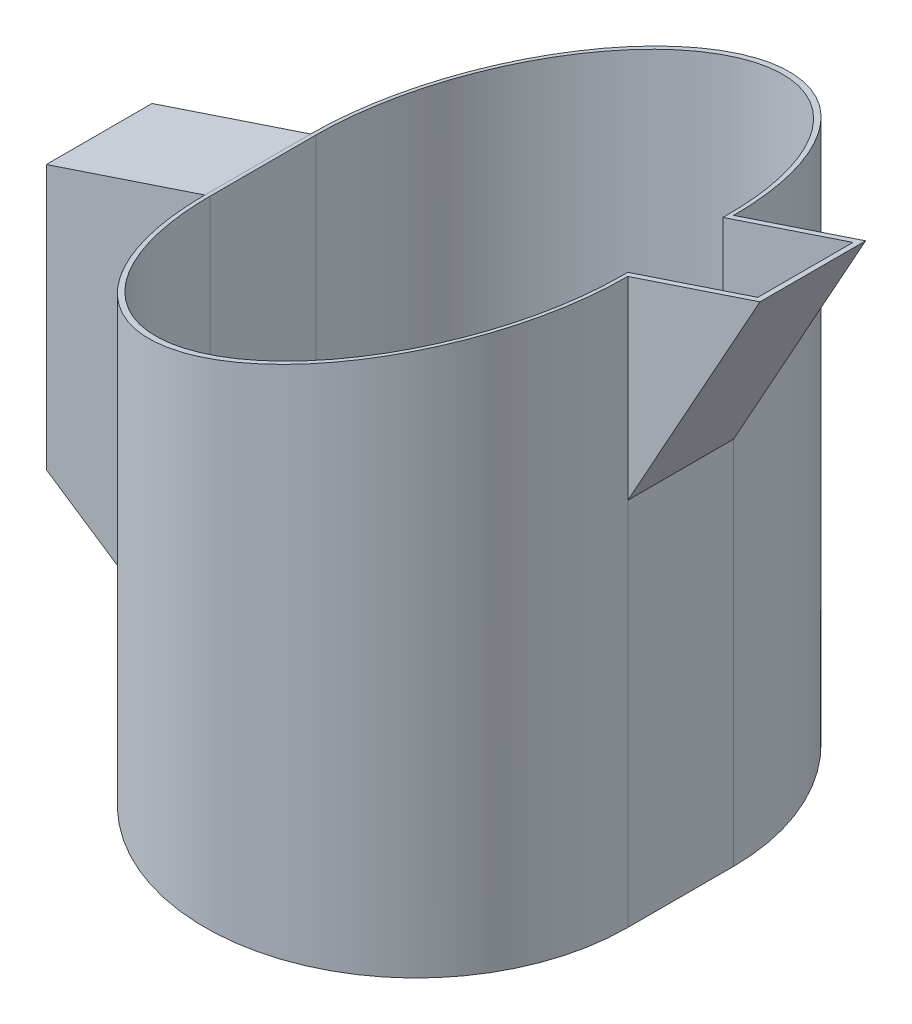
ISO-10303-21;
HEADER;
FILE_DESCRIPTION(('STEP AP214'),'2;1');
FILE_NAME('part.step','',(''),(''),'','','');
FILE_SCHEMA(('AUTOMOTIVE_DESIGN { 1 0 10303 214 1 1 1 1 }'));
ENDSEC;
DATA;
#1=APPLICATION_CONTEXT('core data for automotive mechanical design processes');
#2=APPLICATION_PROTOCOL_DEFINITION('international standard','automotive_design',2000,#1);
#3=PRODUCT_CONTEXT('',#1,'mechanical');
#4=PRODUCT('Part','Part','',(#3));
#5=PRODUCT_RELATED_PRODUCT_CATEGORY('part','',(#4));
#6=PRODUCT_DEFINITION_FORMATION('','',#4);
#7=PRODUCT_DEFINITION_CONTEXT('part definition',#1,'design');
#8=PRODUCT_DEFINITION('design','',#6,#7);
#9=PRODUCT_DEFINITION_SHAPE('','',#8);
#10=(LENGTH_UNIT() NAMED_UNIT(*) SI_UNIT(.MILLI.,.METRE.));
#11=(NAMED_UNIT(*) PLANE_ANGLE_UNIT() SI_UNIT($,.RADIAN.));
#12=(NAMED_UNIT(*) SI_UNIT($,.STERADIAN.) SOLID_ANGLE_UNIT());
#13=UNCERTAINTY_MEASURE_WITH_UNIT(LENGTH_MEASURE(1.E-05),#10,'distance_accuracy_value','');
#14=(GEOMETRIC_REPRESENTATION_CONTEXT(3) GLOBAL_UNCERTAINTY_ASSIGNED_CONTEXT((#13)) GLOBAL_UNIT_ASSIGNED_CONTEXT((#10,
#11,#12)) REPRESENTATION_CONTEXT('',''));
#15=CARTESIAN_POINT('',(0.,0.,0.));
#16=DIRECTION('',(0.,0.,1.));
#17=DIRECTION('',(1.,0.,0.));
#18=AXIS2_PLACEMENT_3D('',#15,#16,#17);
#19=CARTESIAN_POINT('',(65.,115.,10.));
#20=DIRECTION('',(0.316227766016838,-0.948683298050514,0.));
#21=DIRECTION('',(0.948683298050514,0.316227766016838,0.));
#22=AXIS2_PLACEMENT_3D('',#19,#20,#21);
#23=PLANE('',#22);
#24=DIRECTION('',(-0.948683298050514,-0.316227766016838,0.));
#25=VECTOR('',#24,1.);
#26=CARTESIAN_POINT('',(65.,115.,-10.));
#27=LINE('',#26,#25);
#28=CARTESIAN_POINT('',(65.,115.,-10.));
#29=VERTEX_POINT('',#28);
#30=CARTESIAN_POINT('',(40.,106.666666666667,-10.));
#31=VERTEX_POINT('',#30);
#32=EDGE_CURVE('E227',#29,#31,#27,.T.);
#33=ORIENTED_EDGE('',*,*,#32,.T.);
#34=CARTESIAN_POINT('',(0.,93.3333333333333,-10.));
#35=DIRECTION('',(0.316227766016838,-0.948683298050514,0.));
#36=DIRECTION('',(-0.948683298050514,-0.316227766016838,0.));
#37=AXIS2_PLACEMENT_3D('',#34,#35,#36);
#38=ELLIPSE('',#37,42.1637021355784,40.);
#39=CARTESIAN_POINT('',(-40.,80.,-10.));
#40=VERTEX_POINT('',#39);
#41=EDGE_CURVE('E201',#40,#31,#38,.T.);
#42=ORIENTED_EDGE('',*,*,#41,.F.);
#43=DIRECTION('',(0.,0.,1.));
#44=VECTOR('',#43,1.);
#45=CARTESIAN_POINT('',(-40.,80.,-50.));
#46=LINE('',#45,#44);
#47=CARTESIAN_POINT('',(-40.,80.,9.99999999999997));
#48=VERTEX_POINT('',#47);
#49=EDGE_CURVE('E195',#40,#48,#46,.T.);
#50=ORIENTED_EDGE('',*,*,#49,.T.);
#51=CARTESIAN_POINT('',(0.,93.3333333333333,9.99999999999999));
#52=DIRECTION('',(0.316227766016838,-0.948683298050514,0.));
#53=DIRECTION('',(-0.948683298050514,-0.316227766016838,0.));
#54=AXIS2_PLACEMENT_3D('',#51,#52,#53);
#55=ELLIPSE('',#54,42.1637021355784,40.);
#56=CARTESIAN_POINT('',(40.,106.666666666667,10.));
#57=VERTEX_POINT('',#56);
#58=EDGE_CURVE('E199',#57,#48,#55,.T.);
#59=ORIENTED_EDGE('',*,*,#58,.F.);
#60=DIRECTION('',(-0.948683298050514,-0.316227766016838,0.));
#61=VECTOR('',#60,1.);
#62=CARTESIAN_POINT('',(65.,115.,10.));
#63=LINE('',#62,#61);
#64=CARTESIAN_POINT('',(65.,115.,10.));
#65=VERTEX_POINT('',#64);
#66=EDGE_CURVE('E232',#65,#57,#63,.T.);
#67=ORIENTED_EDGE('',*,*,#66,.F.);
#68=DIRECTION('',(0.,0.,-1.));
#69=VECTOR('',#68,1.);
#70=CARTESIAN_POINT('',(65.,115.,10.));
#71=LINE('',#70,#69);
#72=EDGE_CURVE('E49',#65,#29,#71,.T.);
#73=ORIENTED_EDGE('',*,*,#72,.T.);
#74=EDGE_LOOP('',(#33,#42,#50,#59,#67,#73));
#75=FACE_BOUND('',#74,.T.);
#76=DIRECTION('',(-0.948683298050514,-0.316227766016838,0.));
#77=VECTOR('',#76,1.);
#78=CARTESIAN_POINT('',(65.,115.,-9.));
#79=LINE('',#78,#77);
#80=CARTESIAN_POINT('',(63.59605043532,114.532016811773,-9.));
#81=VERTEX_POINT('',#80);
#82=CARTESIAN_POINT('',(39.,106.333333333333,-9.));
#83=VERTEX_POINT('',#82);
#84=EDGE_CURVE('E183',#81,#83,#79,.T.);
#85=ORIENTED_EDGE('',*,*,#84,.F.);
#86=DIRECTION('',(0.,0.,-1.));
#87=VECTOR('',#86,1.);
#88=CARTESIAN_POINT('',(63.59605043532,114.532016811773,10.));
#89=LINE('',#88,#87);
#90=CARTESIAN_POINT('',(63.59605043532,114.532016811773,9.));
#91=VERTEX_POINT('',#90);
#92=EDGE_CURVE('E179',#91,#81,#89,.T.);
#93=ORIENTED_EDGE('',*,*,#92,.F.);
#94=DIRECTION('',(-0.948683298050514,-0.316227766016838,0.));
#95=VECTOR('',#94,1.);
#96=CARTESIAN_POINT('',(65.,115.,9.));
#97=LINE('',#96,#95);
#98=CARTESIAN_POINT('',(39.,106.333333333333,9.));
#99=VERTEX_POINT('',#98);
#100=EDGE_CURVE('E56',#91,#99,#97,.T.);
#101=ORIENTED_EDGE('',*,*,#100,.T.);
#102=DIRECTION('',(0.,0.,1.));
#103=VECTOR('',#102,1.);
#104=CARTESIAN_POINT('',(39.,106.333333333333,-10.));
#105=LINE('',#104,#103);
#106=CARTESIAN_POINT('',(39.,106.333333333333,9.99999999999999));
#107=VERTEX_POINT('',#106);
#108=EDGE_CURVE('E191',#99,#107,#105,.T.);
#109=ORIENTED_EDGE('',*,*,#108,.T.);
#110=CARTESIAN_POINT('',(0.,93.3333333333333,9.99999999999999));
#111=DIRECTION('',(0.316227766016838,-0.948683298050514,0.));
#112=DIRECTION('',(-0.948683298050514,-0.316227766016838,0.));
#113=AXIS2_PLACEMENT_3D('',#110,#111,#112);
#114=ELLIPSE('',#113,41.1096095821889,39.);
#115=CARTESIAN_POINT('',(-39.,80.3333333333333,10.));
#116=VERTEX_POINT('',#115);
#117=EDGE_CURVE('E168',#107,#116,#114,.T.);
#118=ORIENTED_EDGE('',*,*,#117,.T.);
#119=DIRECTION('',(0.,0.,1.));
#120=VECTOR('',#119,1.);
#121=CARTESIAN_POINT('',(-39.,80.3333333333333,10.));
#122=LINE('',#121,#120);
#123=CARTESIAN_POINT('',(-39.,80.3333333333333,-10.));
#124=VERTEX_POINT('',#123);
#125=EDGE_CURVE('E186',#124,#116,#122,.T.);
#126=ORIENTED_EDGE('',*,*,#125,.F.);
#127=CARTESIAN_POINT('',(0.,93.3333333333333,-10.));
#128=DIRECTION('',(0.316227766016838,-0.948683298050514,0.));
#129=DIRECTION('',(-0.948683298050514,-0.316227766016838,0.));
#130=AXIS2_PLACEMENT_3D('',#127,#128,#129);
#131=ELLIPSE('',#130,41.1096095821889,39.);
#132=CARTESIAN_POINT('',(39.,106.333333333333,-10.));
#133=VERTEX_POINT('',#132);
#134=EDGE_CURVE('E165',#124,#133,#131,.T.);
#135=ORIENTED_EDGE('',*,*,#134,.T.);
#136=DIRECTION('',(0.,0.,1.));
#137=VECTOR('',#136,1.);
#138=CARTESIAN_POINT('',(39.,106.333333333333,-10.));
#139=LINE('',#138,#137);
#140=EDGE_CURVE('E145',#133,#83,#139,.T.);
#141=ORIENTED_EDGE('',*,*,#140,.T.);
#142=EDGE_LOOP('',(#85,#93,#101,#109,#118,#126,#135,#141));
#143=FACE_BOUND('',#142,.T.);
#144=ADVANCED_FACE('F42',(#75,#143),#23,.F.);
#145=CARTESIAN_POINT('',(40.,70.,10.));
#146=DIRECTION('',(-0.874157276121538,0.485642931178632,0.));
#147=DIRECTION('',(-0.485642931178632,-0.874157276121538,0.));
#148=AXIS2_PLACEMENT_3D('',#145,#146,#147);
#149=PLANE('',#148);
#150=DIRECTION('',(0.485642931178632,0.874157276121538,0.));
#151=VECTOR('',#150,1.);
#152=CARTESIAN_POINT('',(40.,70.,-10.));
#153=LINE('',#152,#151);
#154=CARTESIAN_POINT('',(40.,70.,-10.));
#155=VERTEX_POINT('',#154);
#156=EDGE_CURVE('E230',#155,#29,#153,.T.);
#157=ORIENTED_EDGE('',*,*,#156,.T.);
#158=ORIENTED_EDGE('',*,*,#72,.F.);
#159=DIRECTION('',(0.485642931178632,0.874157276121538,0.));
#160=VECTOR('',#159,1.);
#161=CARTESIAN_POINT('',(40.,70.,10.));
#162=LINE('',#161,#160);
#163=CARTESIAN_POINT('',(40.,70.,10.));
#164=VERTEX_POINT('',#163);
#165=EDGE_CURVE('E64',#164,#65,#162,.T.);
#166=ORIENTED_EDGE('',*,*,#165,.F.);
#167=DIRECTION('',(0.,0.,-1.));
#168=VECTOR('',#167,1.);
#169=CARTESIAN_POINT('',(40.,70.,10.));
#170=LINE('',#169,#168);
#171=EDGE_CURVE('E12',#164,#155,#170,.T.);
#172=ORIENTED_EDGE('',*,*,#171,.T.);
#173=EDGE_LOOP('',(#157,#158,#166,#172));
#174=FACE_BOUND('',#173,.T.);
#175=ADVANCED_FACE('F260',(#174),#149,.F.);
#176=CARTESIAN_POINT('',(40.,106.666666666667,10.));
#177=DIRECTION('',(0.,0.,1.));
#178=DIRECTION('',(1.,0.,0.));
#179=AXIS2_PLACEMENT_3D('',#176,#177,#178);
#180=PLANE('',#179);
#181=ORIENTED_EDGE('',*,*,#66,.T.);
#182=DIRECTION('',(0.,-1.,0.));
#183=VECTOR('',#182,1.);
#184=CARTESIAN_POINT('',(40.,115.,9.99999999999999));
#185=LINE('',#184,#183);
#186=EDGE_CURVE('E221',#57,#164,#185,.T.);
#187=ORIENTED_EDGE('',*,*,#186,.T.);
#188=ORIENTED_EDGE('',*,*,#165,.T.);
#189=EDGE_LOOP('',(#181,#187,#188));
#190=FACE_BOUND('',#189,.T.);
#191=ADVANCED_FACE('F258',(#190),#180,.T.);
#192=CARTESIAN_POINT('',(40.,106.666666666667,-10.));
#193=DIRECTION('',(0.,0.,1.));
#194=DIRECTION('',(1.,0.,0.));
#195=AXIS2_PLACEMENT_3D('',#192,#193,#194);
#196=PLANE('',#195);
#197=ORIENTED_EDGE('',*,*,#32,.F.);
#198=ORIENTED_EDGE('',*,*,#156,.F.);
#199=DIRECTION('',(0.,-1.,0.));
#200=VECTOR('',#199,1.);
#201=CARTESIAN_POINT('',(40.,115.,-10.));
#202=LINE('',#201,#200);
#203=EDGE_CURVE('E217',#31,#155,#202,.T.);
#204=ORIENTED_EDGE('',*,*,#203,.F.);
#205=EDGE_LOOP('',(#197,#198,#204));
#206=FACE_BOUND('',#205,.T.);
#207=ADVANCED_FACE('F242',(#206),#196,.F.);
#208=CARTESIAN_POINT('',(40.,115.,-10.));
#209=DIRECTION('',(-1.,0.,0.));
#210=DIRECTION('',(0.,0.,1.));
#211=AXIS2_PLACEMENT_3D('',#208,#209,#210);
#212=PLANE('',#211);
#213=CARTESIAN_POINT('',(40.,0.,-10.));
#214=VERTEX_POINT('',#213);
#215=EDGE_CURVE('E216',#155,#214,#202,.T.);
#216=ORIENTED_EDGE('',*,*,#215,.F.);
#217=ORIENTED_EDGE('',*,*,#171,.F.);
#218=CARTESIAN_POINT('',(40.,0.,9.99999999999999));
#219=VERTEX_POINT('',#218);
#220=EDGE_CURVE('E220',#164,#219,#185,.T.);
#221=ORIENTED_EDGE('',*,*,#220,.T.);
#222=DIRECTION('',(0.,0.,-1.));
#223=VECTOR('',#222,1.);
#224=CARTESIAN_POINT('',(40.,0.,-10.));
#225=LINE('',#224,#223);
#226=EDGE_CURVE('E213',#219,#214,#225,.T.);
#227=ORIENTED_EDGE('',*,*,#226,.T.);
#228=EDGE_LOOP('',(#216,#217,#221,#227));
#229=FACE_BOUND('',#228,.T.);
#230=ADVANCED_FACE('F262',(#229),#212,.F.);
#231=CARTESIAN_POINT('',(0.,115.,-10.));
#232=DIRECTION('',(0.,-1.,0.));
#233=DIRECTION('',(0.,0.,-1.));
#234=AXIS2_PLACEMENT_3D('',#231,#232,#233);
#235=CYLINDRICAL_SURFACE('',#234,40.);
#236=DIRECTION('',(0.,-1.,0.));
#237=VECTOR('',#236,1.);
#238=CARTESIAN_POINT('',(-40.,115.,-10.));
#239=LINE('',#238,#237);
#240=CARTESIAN_POINT('',(-40.,0.,-10.));
#241=VERTEX_POINT('',#240);
#242=EDGE_CURVE('E225',#40,#241,#239,.T.);
#243=ORIENTED_EDGE('',*,*,#242,.F.);
#244=ORIENTED_EDGE('',*,*,#41,.T.);
#245=ORIENTED_EDGE('',*,*,#203,.T.);
#246=ORIENTED_EDGE('',*,*,#215,.T.);
#247=CARTESIAN_POINT('',(0.,0.,-10.));
#248=DIRECTION('',(0.,1.,0.));
#249=DIRECTION('',(0.,0.,1.));
#250=AXIS2_PLACEMENT_3D('',#247,#248,#249);
#251=CIRCLE('',#250,40.);
#252=EDGE_CURVE('E204',#214,#241,#251,.T.);
#253=ORIENTED_EDGE('',*,*,#252,.T.);
#254=EDGE_LOOP('',(#243,#244,#245,#246,#253));
#255=FACE_BOUND('',#254,.T.);
#256=ADVANCED_FACE('F245',(#255),#235,.T.);
#257=CARTESIAN_POINT('',(-40.,115.,-10.));
#258=DIRECTION('',(1.,0.,0.));
#259=DIRECTION('',(0.,0.,-1.));
#260=AXIS2_PLACEMENT_3D('',#257,#258,#259);
#261=PLANE('',#260);
#262=DIRECTION('',(0.,-1.,0.));
#263=VECTOR('',#262,1.);
#264=CARTESIAN_POINT('',(-40.,115.,9.99999999999999));
#265=LINE('',#264,#263);
#266=CARTESIAN_POINT('',(-40.,0.,9.99999999999999));
#267=VERTEX_POINT('',#266);
#268=EDGE_CURVE('E223',#48,#267,#265,.T.);
#269=ORIENTED_EDGE('',*,*,#268,.F.);
#270=ORIENTED_EDGE('',*,*,#49,.F.);
#271=ORIENTED_EDGE('',*,*,#242,.T.);
#272=DIRECTION('',(0.,0.,1.));
#273=VECTOR('',#272,1.);
#274=CARTESIAN_POINT('',(-40.,0.,-10.));
#275=LINE('',#274,#273);
#276=EDGE_CURVE('E207',#241,#267,#275,.T.);
#277=ORIENTED_EDGE('',*,*,#276,.T.);
#278=EDGE_LOOP('',(#269,#270,#271,#277));
#279=FACE_BOUND('',#278,.T.);
#280=ADVANCED_FACE('F250',(#279),#261,.F.);
#281=CARTESIAN_POINT('',(0.,115.,9.99999999999999));
#282=DIRECTION('',(0.,-1.,0.));
#283=DIRECTION('',(0.,0.,-1.));
#284=AXIS2_PLACEMENT_3D('',#281,#282,#283);
#285=CYLINDRICAL_SURFACE('',#284,40.);
#286=ORIENTED_EDGE('',*,*,#186,.F.);
#287=ORIENTED_EDGE('',*,*,#58,.T.);
#288=ORIENTED_EDGE('',*,*,#268,.T.);
#289=CARTESIAN_POINT('',(0.,0.,9.99999999999999));
#290=DIRECTION('',(0.,1.,0.));
#291=DIRECTION('',(0.,0.,1.));
#292=AXIS2_PLACEMENT_3D('',#289,#290,#291);
#293=CIRCLE('',#292,40.);
#294=EDGE_CURVE('E210',#267,#219,#293,.T.);
#295=ORIENTED_EDGE('',*,*,#294,.T.);
#296=ORIENTED_EDGE('',*,*,#220,.F.);
#297=EDGE_LOOP('',(#286,#287,#288,#295,#296));
#298=FACE_BOUND('',#297,.T.);
#299=ADVANCED_FACE('F255',(#298),#285,.T.);
#300=CARTESIAN_POINT('',(0.,0.,-10.));
#301=DIRECTION('',(0.,1.,0.));
#302=DIRECTION('',(0.,0.,1.));
#303=AXIS2_PLACEMENT_3D('',#300,#301,#302);
#304=PLANE('',#303);
#305=ORIENTED_EDGE('',*,*,#252,.F.);
#306=ORIENTED_EDGE('',*,*,#226,.F.);
#307=ORIENTED_EDGE('',*,*,#294,.F.);
#308=ORIENTED_EDGE('',*,*,#276,.F.);
#309=EDGE_LOOP('',(#305,#306,#307,#308));
#310=FACE_BOUND('',#309,.T.);
#311=ADVANCED_FACE('F265',(#310),#304,.F.);
#312=CARTESIAN_POINT('',(39.1258427238785,70.4856429311786,10.));
#313=DIRECTION('',(-0.874157276121538,0.485642931178632,0.));
#314=DIRECTION('',(-0.485642931178632,-0.874157276121538,0.));
#315=AXIS2_PLACEMENT_3D('',#312,#313,#314);
#316=PLANE('',#315);
#317=DIRECTION('',(0.485642931178632,0.874157276121538,0.));
#318=VECTOR('',#317,1.);
#319=CARTESIAN_POINT('',(39.1258427238785,70.4856429311786,-9.));
#320=LINE('',#319,#318);
#321=CARTESIAN_POINT('',(39.,70.2591260281974,-9.));
#322=VERTEX_POINT('',#321);
#323=EDGE_CURVE('E184',#322,#81,#320,.T.);
#324=ORIENTED_EDGE('',*,*,#323,.F.);
#325=DIRECTION('',(0.,0.,-1.));
#326=VECTOR('',#325,1.);
#327=CARTESIAN_POINT('',(39.,70.2591260281974,-10.));
#328=LINE('',#327,#326);
#329=CARTESIAN_POINT('',(39.,70.2591260281974,9.));
#330=VERTEX_POINT('',#329);
#331=EDGE_CURVE('E178',#330,#322,#328,.T.);
#332=ORIENTED_EDGE('',*,*,#331,.F.);
#333=DIRECTION('',(0.485642931178632,0.874157276121538,0.));
#334=VECTOR('',#333,1.);
#335=CARTESIAN_POINT('',(39.1258427238785,70.4856429311786,9.));
#336=LINE('',#335,#334);
#337=EDGE_CURVE('E182',#330,#91,#336,.T.);
#338=ORIENTED_EDGE('',*,*,#337,.T.);
#339=ORIENTED_EDGE('',*,*,#92,.T.);
#340=EDGE_LOOP('',(#324,#332,#338,#339));
#341=FACE_BOUND('',#340,.T.);
#342=ADVANCED_FACE('F267',(#341),#316,.T.);
#343=CARTESIAN_POINT('',(40.,106.666666666667,9.));
#344=DIRECTION('',(0.,0.,1.));
#345=DIRECTION('',(1.,0.,0.));
#346=AXIS2_PLACEMENT_3D('',#343,#344,#345);
#347=PLANE('',#346);
#348=ORIENTED_EDGE('',*,*,#100,.F.);
#349=ORIENTED_EDGE('',*,*,#337,.F.);
#350=DIRECTION('',(0.,1.,0.));
#351=VECTOR('',#350,1.);
#352=CARTESIAN_POINT('',(39.,115.,9.));
#353=LINE('',#352,#351);
#354=EDGE_CURVE('E175',#330,#99,#353,.T.);
#355=ORIENTED_EDGE('',*,*,#354,.T.);
#356=EDGE_LOOP('',(#348,#349,#355));
#357=FACE_BOUND('',#356,.T.);
#358=ADVANCED_FACE('F273',(#357),#347,.F.);
#359=CARTESIAN_POINT('',(40.,106.666666666667,-9.));
#360=DIRECTION('',(0.,0.,1.));
#361=DIRECTION('',(1.,0.,0.));
#362=AXIS2_PLACEMENT_3D('',#359,#360,#361);
#363=PLANE('',#362);
#364=ORIENTED_EDGE('',*,*,#84,.T.);
#365=DIRECTION('',(0.,-1.,0.));
#366=VECTOR('',#365,1.);
#367=CARTESIAN_POINT('',(39.,106.666666666667,-9.));
#368=LINE('',#367,#366);
#369=EDGE_CURVE('E177',#322,#83,#368,.F.);
#370=ORIENTED_EDGE('',*,*,#369,.F.);
#371=ORIENTED_EDGE('',*,*,#323,.T.);
#372=EDGE_LOOP('',(#364,#370,#371));
#373=FACE_BOUND('',#372,.T.);
#374=ADVANCED_FACE('F327',(#373),#363,.T.);
#375=CARTESIAN_POINT('',(39.,115.,-10.));
#376=DIRECTION('',(-1.,0.,0.));
#377=DIRECTION('',(0.,0.,1.));
#378=AXIS2_PLACEMENT_3D('',#375,#376,#377);
#379=PLANE('',#378);
#380=DIRECTION('',(0.,-1.,0.));
#381=VECTOR('',#380,1.);
#382=CARTESIAN_POINT('',(39.,115.,-10.));
#383=LINE('',#382,#381);
#384=CARTESIAN_POINT('',(39.,1.,-10.));
#385=VERTEX_POINT('',#384);
#386=EDGE_CURVE('E138',#133,#385,#383,.T.);
#387=ORIENTED_EDGE('',*,*,#386,.T.);
#388=DIRECTION('',(0.,0.,-1.));
#389=VECTOR('',#388,1.);
#390=CARTESIAN_POINT('',(39.,1.,-10.));
#391=LINE('',#390,#389);
#392=CARTESIAN_POINT('',(39.,1.,10.));
#393=VERTEX_POINT('',#392);
#394=EDGE_CURVE('E142',#393,#385,#391,.T.);
#395=ORIENTED_EDGE('',*,*,#394,.F.);
#396=DIRECTION('',(0.,1.,0.));
#397=VECTOR('',#396,1.);
#398=CARTESIAN_POINT('',(39.,115.,10.));
#399=LINE('',#398,#397);
#400=EDGE_CURVE('E149',#107,#393,#399,.F.);
#401=ORIENTED_EDGE('',*,*,#400,.F.);
#402=ORIENTED_EDGE('',*,*,#108,.F.);
#403=ORIENTED_EDGE('',*,*,#354,.F.);
#404=ORIENTED_EDGE('',*,*,#331,.T.);
#405=ORIENTED_EDGE('',*,*,#369,.T.);
#406=ORIENTED_EDGE('',*,*,#140,.F.);
#407=EDGE_LOOP('',(#387,#395,#401,#402,#403,#404,#405,#406));
#408=FACE_BOUND('',#407,.T.);
#409=ADVANCED_FACE('F140',(#408),#379,.T.);
#410=CARTESIAN_POINT('',(0.,115.,-10.));
#411=DIRECTION('',(0.,-1.,0.));
#412=DIRECTION('',(0.,0.,-1.));
#413=AXIS2_PLACEMENT_3D('',#410,#411,#412);
#414=CYLINDRICAL_SURFACE('',#413,39.);
#415=DIRECTION('',(0.,1.,0.));
#416=VECTOR('',#415,1.);
#417=CARTESIAN_POINT('',(-39.,115.,-10.));
#418=LINE('',#417,#416);
#419=CARTESIAN_POINT('',(-39.,1.,-10.));
#420=VERTEX_POINT('',#419);
#421=EDGE_CURVE('E162',#124,#420,#418,.F.);
#422=ORIENTED_EDGE('',*,*,#421,.T.);
#423=CARTESIAN_POINT('',(0.,1.,-10.));
#424=DIRECTION('',(0.,1.,0.));
#425=DIRECTION('',(0.,0.,1.));
#426=AXIS2_PLACEMENT_3D('',#423,#424,#425);
#427=CIRCLE('',#426,39.);
#428=EDGE_CURVE('E156',#385,#420,#427,.T.);
#429=ORIENTED_EDGE('',*,*,#428,.F.);
#430=ORIENTED_EDGE('',*,*,#386,.F.);
#431=ORIENTED_EDGE('',*,*,#134,.F.);
#432=EDGE_LOOP('',(#422,#429,#430,#431));
#433=FACE_BOUND('',#432,.T.);
#434=ADVANCED_FACE('F160',(#433),#414,.F.);
#435=CARTESIAN_POINT('',(-39.,115.,-10.));
#436=DIRECTION('',(1.,0.,0.));
#437=DIRECTION('',(0.,0.,-1.));
#438=AXIS2_PLACEMENT_3D('',#435,#436,#437);
#439=PLANE('',#438);
#440=DIRECTION('',(0.,-1.,0.));
#441=VECTOR('',#440,1.);
#442=CARTESIAN_POINT('',(-39.,115.,10.));
#443=LINE('',#442,#441);
#444=CARTESIAN_POINT('',(-39.,1.,10.));
#445=VERTEX_POINT('',#444);
#446=EDGE_CURVE('E172',#116,#445,#443,.T.);
#447=ORIENTED_EDGE('',*,*,#446,.T.);
#448=DIRECTION('',(0.,0.,1.));
#449=VECTOR('',#448,1.);
#450=CARTESIAN_POINT('',(-39.,1.,-10.));
#451=LINE('',#450,#449);
#452=EDGE_CURVE('E164',#420,#445,#451,.T.);
#453=ORIENTED_EDGE('',*,*,#452,.F.);
#454=ORIENTED_EDGE('',*,*,#421,.F.);
#455=ORIENTED_EDGE('',*,*,#125,.T.);
#456=EDGE_LOOP('',(#447,#453,#454,#455));
#457=FACE_BOUND('',#456,.T.);
#458=ADVANCED_FACE('F350',(#457),#439,.T.);
#459=CARTESIAN_POINT('',(0.,115.,9.99999999999999));
#460=DIRECTION('',(0.,-1.,0.));
#461=DIRECTION('',(0.,0.,-1.));
#462=AXIS2_PLACEMENT_3D('',#459,#460,#461);
#463=CYLINDRICAL_SURFACE('',#462,39.);
#464=ORIENTED_EDGE('',*,*,#400,.T.);
#465=CARTESIAN_POINT('',(0.,1.,9.99999999999999));
#466=DIRECTION('',(0.,1.,0.));
#467=DIRECTION('',(0.,0.,1.));
#468=AXIS2_PLACEMENT_3D('',#465,#466,#467);
#469=CIRCLE('',#468,39.);
#470=EDGE_CURVE('E158',#445,#393,#469,.T.);
#471=ORIENTED_EDGE('',*,*,#470,.F.);
#472=ORIENTED_EDGE('',*,*,#446,.F.);
#473=ORIENTED_EDGE('',*,*,#117,.F.);
#474=EDGE_LOOP('',(#464,#471,#472,#473));
#475=FACE_BOUND('',#474,.T.);
#476=ADVANCED_FACE('F358',(#475),#463,.F.);
#477=CARTESIAN_POINT('',(0.,1.,-10.));
#478=DIRECTION('',(0.,1.,0.));
#479=DIRECTION('',(0.,0.,1.));
#480=AXIS2_PLACEMENT_3D('',#477,#478,#479);
#481=PLANE('',#480);
#482=ORIENTED_EDGE('',*,*,#428,.T.);
#483=ORIENTED_EDGE('',*,*,#452,.T.);
#484=ORIENTED_EDGE('',*,*,#470,.T.);
#485=ORIENTED_EDGE('',*,*,#394,.T.);
#486=EDGE_LOOP('',(#482,#483,#484,#485));
#487=FACE_BOUND('',#486,.T.);
#488=ADVANCED_FACE('F154',(#487),#481,.T.);
#489=CLOSED_SHELL('',(#144,#175,#191,#207,#230,#256,#280,#299,#311,#342,#358,#374,#409,#434,
#458,#476,#488));
#490=MANIFOLD_SOLID_BREP('B2',#489);
#491=CARTESIAN_POINT('',(-40.,0.,10.));
#492=DIRECTION('',(-1.,0.,0.));
#493=DIRECTION('',(0.,-1.,0.));
#494=AXIS2_PLACEMENT_3D('',#491,#492,#493);
#495=PLANE('',#494);
#496=DIRECTION('',(0.,1.,0.));
#497=VECTOR('',#496,1.);
#498=CARTESIAN_POINT('',(-40.,0.,-10.));
#499=LINE('',#498,#497);
#500=CARTESIAN_POINT('',(-40.,0.,-10.));
#501=VERTEX_POINT('',#500);
#502=CARTESIAN_POINT('',(-40.,80.,-10.));
#503=VERTEX_POINT('',#502);
#504=EDGE_CURVE('E486',#501,#503,#499,.T.);
#505=ORIENTED_EDGE('',*,*,#504,.T.);
#506=DIRECTION('',(0.,0.,-1.));
#507=VECTOR('',#506,1.);
#508=CARTESIAN_POINT('',(-40.,80.,10.));
#509=LINE('',#508,#507);
#510=CARTESIAN_POINT('',(-40.,80.,10.));
#511=VERTEX_POINT('',#510);
#512=EDGE_CURVE('E40',#511,#503,#509,.T.);
#513=ORIENTED_EDGE('',*,*,#512,.F.);
#514=DIRECTION('',(0.,1.,0.));
#515=VECTOR('',#514,1.);
#516=CARTESIAN_POINT('',(-40.,0.,10.));
#517=LINE('',#516,#515);
#518=CARTESIAN_POINT('',(-40.,0.,10.));
#519=VERTEX_POINT('',#518);
#520=EDGE_CURVE('E504',#519,#511,#517,.T.);
#521=ORIENTED_EDGE('',*,*,#520,.F.);
#522=DIRECTION('',(0.,0.,-1.));
#523=VECTOR('',#522,1.);
#524=CARTESIAN_POINT('',(-40.,0.,10.));
#525=LINE('',#524,#523);
#526=EDGE_CURVE('E498',#519,#501,#525,.T.);
#527=ORIENTED_EDGE('',*,*,#526,.T.);
#528=EDGE_LOOP('',(#505,#513,#521,#527));
#529=FACE_BOUND('',#528,.T.);
#530=ADVANCED_FACE('F442',(#529),#495,.F.);
#531=CARTESIAN_POINT('',(-40.,80.,10.));
#532=DIRECTION('',(0.316227766016837,-0.948683298050514,0.));
#533=DIRECTION('',(0.948683298050514,0.316227766016837,0.));
#534=AXIS2_PLACEMENT_3D('',#531,#532,#533);
#535=PLANE('',#534);
#536=DIRECTION('',(-0.948683298050514,-0.316227766016837,0.));
#537=VECTOR('',#536,1.);
#538=CARTESIAN_POINT('',(-40.,80.,-10.));
#539=LINE('',#538,#537);
#540=CARTESIAN_POINT('',(-70.,70.,-10.));
#541=VERTEX_POINT('',#540);
#542=EDGE_CURVE('E482',#503,#541,#539,.T.);
#543=ORIENTED_EDGE('',*,*,#542,.T.);
#544=DIRECTION('',(0.,0.,-1.));
#545=VECTOR('',#544,1.);
#546=CARTESIAN_POINT('',(-70.,70.,10.));
#547=LINE('',#546,#545);
#548=CARTESIAN_POINT('',(-70.,70.,10.));
#549=VERTEX_POINT('',#548);
#550=EDGE_CURVE('E449',#549,#541,#547,.T.);
#551=ORIENTED_EDGE('',*,*,#550,.F.);
#552=DIRECTION('',(-0.948683298050514,-0.316227766016837,0.));
#553=VECTOR('',#552,1.);
#554=CARTESIAN_POINT('',(-40.,80.,10.));
#555=LINE('',#554,#553);
#556=EDGE_CURVE('E494',#511,#549,#555,.T.);
#557=ORIENTED_EDGE('',*,*,#556,.F.);
#558=ORIENTED_EDGE('',*,*,#512,.T.);
#559=EDGE_LOOP('',(#543,#551,#557,#558));
#560=FACE_BOUND('',#559,.T.);
#561=ADVANCED_FACE('F493',(#560),#535,.F.);
#562=CARTESIAN_POINT('',(-70.,20.,10.));
#563=DIRECTION('',(1.,0.,0.));
#564=DIRECTION('',(0.,0.,-1.));
#565=AXIS2_PLACEMENT_3D('',#562,#563,#564);
#566=PLANE('',#565);
#567=DIRECTION('',(0.,-1.,0.));
#568=VECTOR('',#567,1.);
#569=CARTESIAN_POINT('',(-70.,20.,-10.));
#570=LINE('',#569,#568);
#571=CARTESIAN_POINT('',(-70.,20.,-10.));
#572=VERTEX_POINT('',#571);
#573=EDGE_CURVE('E487',#541,#572,#570,.T.);
#574=ORIENTED_EDGE('',*,*,#573,.T.);
#575=DIRECTION('',(0.,0.,-1.));
#576=VECTOR('',#575,1.);
#577=CARTESIAN_POINT('',(-70.,20.,10.));
#578=LINE('',#577,#576);
#579=CARTESIAN_POINT('',(-70.,20.,10.));
#580=VERTEX_POINT('',#579);
#581=EDGE_CURVE('E510',#580,#572,#578,.T.);
#582=ORIENTED_EDGE('',*,*,#581,.F.);
#583=DIRECTION('',(0.,-1.,0.));
#584=VECTOR('',#583,1.);
#585=CARTESIAN_POINT('',(-70.,20.,10.));
#586=LINE('',#585,#584);
#587=EDGE_CURVE('E461',#549,#580,#586,.T.);
#588=ORIENTED_EDGE('',*,*,#587,.F.);
#589=ORIENTED_EDGE('',*,*,#550,.T.);
#590=EDGE_LOOP('',(#574,#582,#588,#589));
#591=FACE_BOUND('',#590,.T.);
#592=ADVANCED_FACE('F513',(#591),#566,.F.);
#593=CARTESIAN_POINT('',(-70.,20.,10.));
#594=DIRECTION('',(0.554700196225229,0.832050294337844,0.));
#595=DIRECTION('',(-0.832050294337844,0.554700196225229,0.));
#596=AXIS2_PLACEMENT_3D('',#593,#594,#595);
#597=PLANE('',#596);
#598=DIRECTION('',(0.832050294337844,-0.554700196225229,0.));
#599=VECTOR('',#598,1.);
#600=CARTESIAN_POINT('',(-70.,20.,-10.));
#601=LINE('',#600,#599);
#602=EDGE_CURVE('E502',#572,#501,#601,.T.);
#603=ORIENTED_EDGE('',*,*,#602,.T.);
#604=ORIENTED_EDGE('',*,*,#526,.F.);
#605=DIRECTION('',(0.832050294337844,-0.554700196225229,0.));
#606=VECTOR('',#605,1.);
#607=CARTESIAN_POINT('',(-70.,20.,10.));
#608=LINE('',#607,#606);
#609=EDGE_CURVE('E456',#580,#519,#608,.T.);
#610=ORIENTED_EDGE('',*,*,#609,.F.);
#611=ORIENTED_EDGE('',*,*,#581,.T.);
#612=EDGE_LOOP('',(#603,#604,#610,#611));
#613=FACE_BOUND('',#612,.T.);
#614=ADVANCED_FACE('F515',(#613),#597,.F.);
#615=CARTESIAN_POINT('',(-40.,80.,10.));
#616=DIRECTION('',(0.,0.,1.));
#617=DIRECTION('',(1.,0.,0.));
#618=AXIS2_PLACEMENT_3D('',#615,#616,#617);
#619=PLANE('',#618);
#620=ORIENTED_EDGE('',*,*,#520,.T.);
#621=ORIENTED_EDGE('',*,*,#556,.T.);
#622=ORIENTED_EDGE('',*,*,#587,.T.);
#623=ORIENTED_EDGE('',*,*,#609,.T.);
#624=EDGE_LOOP('',(#620,#621,#622,#623));
#625=FACE_BOUND('',#624,.T.);
#626=ADVANCED_FACE('F516',(#625),#619,.T.);
#627=CARTESIAN_POINT('',(-40.,80.,-10.));
#628=DIRECTION('',(0.,0.,1.));
#629=DIRECTION('',(1.,0.,0.));
#630=AXIS2_PLACEMENT_3D('',#627,#628,#629);
#631=PLANE('',#630);
#632=ORIENTED_EDGE('',*,*,#504,.F.);
#633=ORIENTED_EDGE('',*,*,#602,.F.);
#634=ORIENTED_EDGE('',*,*,#573,.F.);
#635=ORIENTED_EDGE('',*,*,#542,.F.);
#636=EDGE_LOOP('',(#632,#633,#634,#635));
#637=FACE_BOUND('',#636,.T.);
#638=ADVANCED_FACE('F483',(#637),#631,.F.);
#639=CLOSED_SHELL('',(#530,#561,#592,#614,#626,#638));
#640=MANIFOLD_SOLID_BREP('B6',#639);
#641=ADVANCED_BREP_SHAPE_REPRESENTATION('',(#18,#490,#640),#14);
#642=SHAPE_DEFINITION_REPRESENTATION(#9,#641);
ENDSEC;
END-ISO-10303-21;
